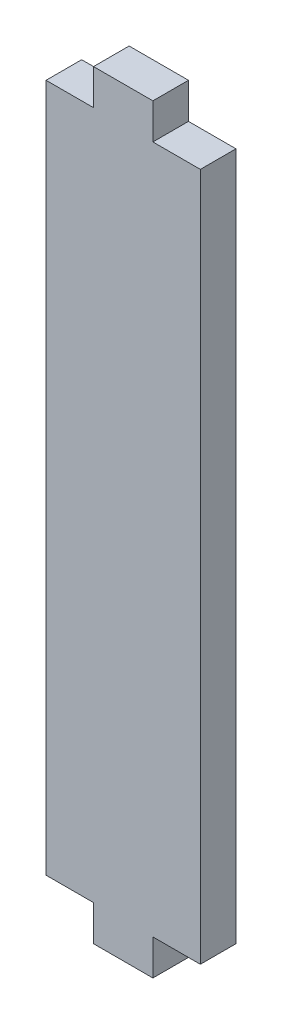
ISO-10303-21;
HEADER;
FILE_DESCRIPTION(('STEP AP214'),'2;1');
FILE_NAME('part.step','',(''),(''),'','','');
FILE_SCHEMA(('AUTOMOTIVE_DESIGN { 1 0 10303 214 1 1 1 1 }'));
ENDSEC;
DATA;
#1=APPLICATION_CONTEXT('core data for automotive mechanical design processes');
#2=APPLICATION_PROTOCOL_DEFINITION('international standard','automotive_design',2000,#1);
#3=PRODUCT_CONTEXT('',#1,'mechanical');
#4=PRODUCT('Part','Part','',(#3));
#5=PRODUCT_RELATED_PRODUCT_CATEGORY('part','',(#4));
#6=PRODUCT_DEFINITION_FORMATION('','',#4);
#7=PRODUCT_DEFINITION_CONTEXT('part definition',#1,'design');
#8=PRODUCT_DEFINITION('design','',#6,#7);
#9=PRODUCT_DEFINITION_SHAPE('','',#8);
#10=(LENGTH_UNIT() NAMED_UNIT(*) SI_UNIT(.MILLI.,.METRE.));
#11=(NAMED_UNIT(*) PLANE_ANGLE_UNIT() SI_UNIT($,.RADIAN.));
#12=(NAMED_UNIT(*) SI_UNIT($,.STERADIAN.) SOLID_ANGLE_UNIT());
#13=UNCERTAINTY_MEASURE_WITH_UNIT(LENGTH_MEASURE(1.E-05),#10,'distance_accuracy_value','');
#14=(GEOMETRIC_REPRESENTATION_CONTEXT(3) GLOBAL_UNCERTAINTY_ASSIGNED_CONTEXT((#13)) GLOBAL_UNIT_ASSIGNED_CONTEXT((#10,
#11,#12)) REPRESENTATION_CONTEXT('',''));
#15=CARTESIAN_POINT('',(0.,0.,0.));
#16=DIRECTION('',(0.,0.,1.));
#17=DIRECTION('',(1.,0.,0.));
#18=AXIS2_PLACEMENT_3D('',#15,#16,#17);
#19=CARTESIAN_POINT('',(6.5,-29.,3.));
#20=DIRECTION('',(0.,1.,0.));
#21=DIRECTION('',(0.,0.,1.));
#22=AXIS2_PLACEMENT_3D('',#19,#20,#21);
#23=PLANE('',#22);
#24=DIRECTION('',(1.,0.,0.));
#25=VECTOR('',#24,1.);
#26=CARTESIAN_POINT('',(6.5,-29.,0.));
#27=LINE('',#26,#25);
#28=CARTESIAN_POINT('',(2.5,-29.,0.));
#29=VERTEX_POINT('',#28);
#30=CARTESIAN_POINT('',(6.5,-29.,0.));
#31=VERTEX_POINT('',#30);
#32=EDGE_CURVE('E157',#29,#31,#27,.T.);
#33=ORIENTED_EDGE('',*,*,#32,.T.);
#34=DIRECTION('',(0.,0.,-1.));
#35=VECTOR('',#34,1.);
#36=CARTESIAN_POINT('',(6.5,-29.,3.));
#37=LINE('',#36,#35);
#38=CARTESIAN_POINT('',(6.5,-29.,3.));
#39=VERTEX_POINT('',#38);
#40=EDGE_CURVE('E11',#39,#31,#37,.T.);
#41=ORIENTED_EDGE('',*,*,#40,.F.);
#42=DIRECTION('',(1.,0.,0.));
#43=VECTOR('',#42,1.);
#44=CARTESIAN_POINT('',(6.5,-29.,3.));
#45=LINE('',#44,#43);
#46=CARTESIAN_POINT('',(2.5,-29.,3.));
#47=VERTEX_POINT('',#46);
#48=EDGE_CURVE('E179',#47,#39,#45,.T.);
#49=ORIENTED_EDGE('',*,*,#48,.F.);
#50=DIRECTION('',(0.,0.,-1.));
#51=VECTOR('',#50,1.);
#52=CARTESIAN_POINT('',(2.5,-29.,3.));
#53=LINE('',#52,#51);
#54=EDGE_CURVE('E153',#47,#29,#53,.T.);
#55=ORIENTED_EDGE('',*,*,#54,.T.);
#56=EDGE_LOOP('',(#33,#41,#49,#55));
#57=FACE_BOUND('',#56,.T.);
#58=ADVANCED_FACE('F37',(#57),#23,.F.);
#59=CARTESIAN_POINT('',(6.5,29.,3.));
#60=DIRECTION('',(-1.,0.,0.));
#61=DIRECTION('',(0.,0.,1.));
#62=AXIS2_PLACEMENT_3D('',#59,#60,#61);
#63=PLANE('',#62);
#64=DIRECTION('',(0.,1.,0.));
#65=VECTOR('',#64,1.);
#66=CARTESIAN_POINT('',(6.5,29.,0.));
#67=LINE('',#66,#65);
#68=CARTESIAN_POINT('',(6.5,29.,0.));
#69=VERTEX_POINT('',#68);
#70=EDGE_CURVE('E160',#31,#69,#67,.T.);
#71=ORIENTED_EDGE('',*,*,#70,.T.);
#72=DIRECTION('',(0.,0.,-1.));
#73=VECTOR('',#72,1.);
#74=CARTESIAN_POINT('',(6.5,29.,3.));
#75=LINE('',#74,#73);
#76=CARTESIAN_POINT('',(6.5,29.,3.));
#77=VERTEX_POINT('',#76);
#78=EDGE_CURVE('E45',#77,#69,#75,.T.);
#79=ORIENTED_EDGE('',*,*,#78,.F.);
#80=DIRECTION('',(0.,1.,0.));
#81=VECTOR('',#80,1.);
#82=CARTESIAN_POINT('',(6.5,29.,3.));
#83=LINE('',#82,#81);
#84=EDGE_CURVE('E108',#39,#77,#83,.T.);
#85=ORIENTED_EDGE('',*,*,#84,.F.);
#86=ORIENTED_EDGE('',*,*,#40,.T.);
#87=EDGE_LOOP('',(#71,#79,#85,#86));
#88=FACE_BOUND('',#87,.T.);
#89=ADVANCED_FACE('F257',(#88),#63,.F.);
#90=CARTESIAN_POINT('',(2.5,29.,3.));
#91=DIRECTION('',(0.,-1.,0.));
#92=DIRECTION('',(0.,0.,-1.));
#93=AXIS2_PLACEMENT_3D('',#90,#91,#92);
#94=PLANE('',#93);
#95=DIRECTION('',(-1.,0.,0.));
#96=VECTOR('',#95,1.);
#97=CARTESIAN_POINT('',(2.5,29.,0.));
#98=LINE('',#97,#96);
#99=CARTESIAN_POINT('',(2.5,29.,0.));
#100=VERTEX_POINT('',#99);
#101=EDGE_CURVE('E162',#69,#100,#98,.T.);
#102=ORIENTED_EDGE('',*,*,#101,.T.);
#103=DIRECTION('',(0.,0.,-1.));
#104=VECTOR('',#103,1.);
#105=CARTESIAN_POINT('',(2.5,29.,3.));
#106=LINE('',#105,#104);
#107=CARTESIAN_POINT('',(2.5,29.,3.));
#108=VERTEX_POINT('',#107);
#109=EDGE_CURVE('E198',#108,#100,#106,.T.);
#110=ORIENTED_EDGE('',*,*,#109,.F.);
#111=DIRECTION('',(-1.,0.,0.));
#112=VECTOR('',#111,1.);
#113=CARTESIAN_POINT('',(2.5,29.,3.));
#114=LINE('',#113,#112);
#115=EDGE_CURVE('E206',#77,#108,#114,.T.);
#116=ORIENTED_EDGE('',*,*,#115,.F.);
#117=ORIENTED_EDGE('',*,*,#78,.T.);
#118=EDGE_LOOP('',(#102,#110,#116,#117));
#119=FACE_BOUND('',#118,.T.);
#120=ADVANCED_FACE('F204',(#119),#94,.F.);
#121=CARTESIAN_POINT('',(2.5,32.,3.));
#122=DIRECTION('',(-1.,0.,0.));
#123=DIRECTION('',(0.,-1.,0.));
#124=AXIS2_PLACEMENT_3D('',#121,#122,#123);
#125=PLANE('',#124);
#126=DIRECTION('',(0.,1.,0.));
#127=VECTOR('',#126,1.);
#128=CARTESIAN_POINT('',(2.5,32.,0.));
#129=LINE('',#128,#127);
#130=CARTESIAN_POINT('',(2.5,32.,0.));
#131=VERTEX_POINT('',#130);
#132=EDGE_CURVE('E164',#100,#131,#129,.T.);
#133=ORIENTED_EDGE('',*,*,#132,.T.);
#134=DIRECTION('',(0.,0.,-1.));
#135=VECTOR('',#134,1.);
#136=CARTESIAN_POINT('',(2.5,32.,3.));
#137=LINE('',#136,#135);
#138=CARTESIAN_POINT('',(2.5,32.,3.));
#139=VERTEX_POINT('',#138);
#140=EDGE_CURVE('E195',#139,#131,#137,.T.);
#141=ORIENTED_EDGE('',*,*,#140,.F.);
#142=DIRECTION('',(0.,1.,0.));
#143=VECTOR('',#142,1.);
#144=CARTESIAN_POINT('',(2.5,32.,3.));
#145=LINE('',#144,#143);
#146=EDGE_CURVE('E224',#108,#139,#145,.T.);
#147=ORIENTED_EDGE('',*,*,#146,.F.);
#148=ORIENTED_EDGE('',*,*,#109,.T.);
#149=EDGE_LOOP('',(#133,#141,#147,#148));
#150=FACE_BOUND('',#149,.T.);
#151=ADVANCED_FACE('F215',(#150),#125,.F.);
#152=CARTESIAN_POINT('',(-2.5,32.,3.));
#153=DIRECTION('',(0.,-1.,0.));
#154=DIRECTION('',(1.,0.,0.));
#155=AXIS2_PLACEMENT_3D('',#152,#153,#154);
#156=PLANE('',#155);
#157=DIRECTION('',(-1.,0.,0.));
#158=VECTOR('',#157,1.);
#159=CARTESIAN_POINT('',(-2.5,32.,0.));
#160=LINE('',#159,#158);
#161=CARTESIAN_POINT('',(-2.5,32.,0.));
#162=VERTEX_POINT('',#161);
#163=EDGE_CURVE('E166',#131,#162,#160,.T.);
#164=ORIENTED_EDGE('',*,*,#163,.T.);
#165=DIRECTION('',(0.,0.,-1.));
#166=VECTOR('',#165,1.);
#167=CARTESIAN_POINT('',(-2.5,32.,3.));
#168=LINE('',#167,#166);
#169=CARTESIAN_POINT('',(-2.5,32.,3.));
#170=VERTEX_POINT('',#169);
#171=EDGE_CURVE('E192',#170,#162,#168,.T.);
#172=ORIENTED_EDGE('',*,*,#171,.F.);
#173=DIRECTION('',(-1.,0.,0.));
#174=VECTOR('',#173,1.);
#175=CARTESIAN_POINT('',(-2.5,32.,3.));
#176=LINE('',#175,#174);
#177=EDGE_CURVE('E221',#139,#170,#176,.T.);
#178=ORIENTED_EDGE('',*,*,#177,.F.);
#179=ORIENTED_EDGE('',*,*,#140,.T.);
#180=EDGE_LOOP('',(#164,#172,#178,#179));
#181=FACE_BOUND('',#180,.T.);
#182=ADVANCED_FACE('F219',(#181),#156,.F.);
#183=CARTESIAN_POINT('',(-2.5,29.,3.));
#184=DIRECTION('',(1.,0.,0.));
#185=DIRECTION('',(0.,1.,0.));
#186=AXIS2_PLACEMENT_3D('',#183,#184,#185);
#187=PLANE('',#186);
#188=DIRECTION('',(0.,-1.,0.));
#189=VECTOR('',#188,1.);
#190=CARTESIAN_POINT('',(-2.5,29.,0.));
#191=LINE('',#190,#189);
#192=CARTESIAN_POINT('',(-2.5,29.,0.));
#193=VERTEX_POINT('',#192);
#194=EDGE_CURVE('E168',#162,#193,#191,.T.);
#195=ORIENTED_EDGE('',*,*,#194,.T.);
#196=DIRECTION('',(0.,0.,-1.));
#197=VECTOR('',#196,1.);
#198=CARTESIAN_POINT('',(-2.5,29.,3.));
#199=LINE('',#198,#197);
#200=CARTESIAN_POINT('',(-2.5,29.,3.));
#201=VERTEX_POINT('',#200);
#202=EDGE_CURVE('E189',#201,#193,#199,.T.);
#203=ORIENTED_EDGE('',*,*,#202,.F.);
#204=DIRECTION('',(0.,-1.,0.));
#205=VECTOR('',#204,1.);
#206=CARTESIAN_POINT('',(-2.5,29.,3.));
#207=LINE('',#206,#205);
#208=EDGE_CURVE('E223',#170,#201,#207,.T.);
#209=ORIENTED_EDGE('',*,*,#208,.F.);
#210=ORIENTED_EDGE('',*,*,#171,.T.);
#211=EDGE_LOOP('',(#195,#203,#209,#210));
#212=FACE_BOUND('',#211,.T.);
#213=ADVANCED_FACE('F270',(#212),#187,.F.);
#214=CARTESIAN_POINT('',(-6.5,29.,3.));
#215=DIRECTION('',(0.,-1.,0.));
#216=DIRECTION('',(0.,0.,-1.));
#217=AXIS2_PLACEMENT_3D('',#214,#215,#216);
#218=PLANE('',#217);
#219=DIRECTION('',(-1.,0.,0.));
#220=VECTOR('',#219,1.);
#221=CARTESIAN_POINT('',(-6.5,29.,0.));
#222=LINE('',#221,#220);
#223=CARTESIAN_POINT('',(-6.5,29.,0.));
#224=VERTEX_POINT('',#223);
#225=EDGE_CURVE('E170',#193,#224,#222,.T.);
#226=ORIENTED_EDGE('',*,*,#225,.T.);
#227=DIRECTION('',(0.,0.,-1.));
#228=VECTOR('',#227,1.);
#229=CARTESIAN_POINT('',(-6.5,29.,3.));
#230=LINE('',#229,#228);
#231=CARTESIAN_POINT('',(-6.5,29.,3.));
#232=VERTEX_POINT('',#231);
#233=EDGE_CURVE('E186',#232,#224,#230,.T.);
#234=ORIENTED_EDGE('',*,*,#233,.F.);
#235=DIRECTION('',(-1.,0.,0.));
#236=VECTOR('',#235,1.);
#237=CARTESIAN_POINT('',(-6.5,29.,3.));
#238=LINE('',#237,#236);
#239=EDGE_CURVE('E226',#201,#232,#238,.T.);
#240=ORIENTED_EDGE('',*,*,#239,.F.);
#241=ORIENTED_EDGE('',*,*,#202,.T.);
#242=EDGE_LOOP('',(#226,#234,#240,#241));
#243=FACE_BOUND('',#242,.T.);
#244=ADVANCED_FACE('F273',(#243),#218,.F.);
#245=CARTESIAN_POINT('',(-6.5,29.,3.));
#246=DIRECTION('',(1.,0.,0.));
#247=DIRECTION('',(0.,0.,-1.));
#248=AXIS2_PLACEMENT_3D('',#245,#246,#247);
#249=PLANE('',#248);
#250=DIRECTION('',(0.,-1.,0.));
#251=VECTOR('',#250,1.);
#252=CARTESIAN_POINT('',(-6.5,29.,0.));
#253=LINE('',#252,#251);
#254=CARTESIAN_POINT('',(-6.5,-29.,0.));
#255=VERTEX_POINT('',#254);
#256=EDGE_CURVE('E172',#224,#255,#253,.T.);
#257=ORIENTED_EDGE('',*,*,#256,.T.);
#258=DIRECTION('',(0.,0.,-1.));
#259=VECTOR('',#258,1.);
#260=CARTESIAN_POINT('',(-6.5,-29.,3.));
#261=LINE('',#260,#259);
#262=CARTESIAN_POINT('',(-6.5,-29.,3.));
#263=VERTEX_POINT('',#262);
#264=EDGE_CURVE('E183',#263,#255,#261,.T.);
#265=ORIENTED_EDGE('',*,*,#264,.F.);
#266=DIRECTION('',(0.,-1.,0.));
#267=VECTOR('',#266,1.);
#268=CARTESIAN_POINT('',(-6.5,29.,3.));
#269=LINE('',#268,#267);
#270=EDGE_CURVE('E232',#232,#263,#269,.T.);
#271=ORIENTED_EDGE('',*,*,#270,.F.);
#272=ORIENTED_EDGE('',*,*,#233,.T.);
#273=EDGE_LOOP('',(#257,#265,#271,#272));
#274=FACE_BOUND('',#273,.T.);
#275=ADVANCED_FACE('F238',(#274),#249,.F.);
#276=CARTESIAN_POINT('',(-2.5,-29.,3.));
#277=DIRECTION('',(0.,1.,0.));
#278=DIRECTION('',(0.,0.,1.));
#279=AXIS2_PLACEMENT_3D('',#276,#277,#278);
#280=PLANE('',#279);
#281=DIRECTION('',(1.,0.,0.));
#282=VECTOR('',#281,1.);
#283=CARTESIAN_POINT('',(-2.5,-29.,0.));
#284=LINE('',#283,#282);
#285=CARTESIAN_POINT('',(-2.5,-29.,0.));
#286=VERTEX_POINT('',#285);
#287=EDGE_CURVE('E174',#255,#286,#284,.T.);
#288=ORIENTED_EDGE('',*,*,#287,.T.);
#289=DIRECTION('',(0.,0.,-1.));
#290=VECTOR('',#289,1.);
#291=CARTESIAN_POINT('',(-2.5,-29.,3.));
#292=LINE('',#291,#290);
#293=CARTESIAN_POINT('',(-2.5,-29.,3.));
#294=VERTEX_POINT('',#293);
#295=EDGE_CURVE('E148',#294,#286,#292,.T.);
#296=ORIENTED_EDGE('',*,*,#295,.F.);
#297=DIRECTION('',(1.,0.,0.));
#298=VECTOR('',#297,1.);
#299=CARTESIAN_POINT('',(-2.5,-29.,3.));
#300=LINE('',#299,#298);
#301=EDGE_CURVE('E139',#263,#294,#300,.T.);
#302=ORIENTED_EDGE('',*,*,#301,.F.);
#303=ORIENTED_EDGE('',*,*,#264,.T.);
#304=EDGE_LOOP('',(#288,#296,#302,#303));
#305=FACE_BOUND('',#304,.T.);
#306=ADVANCED_FACE('F242',(#305),#280,.F.);
#307=CARTESIAN_POINT('',(-2.5,-32.,3.));
#308=DIRECTION('',(1.,0.,0.));
#309=DIRECTION('',(0.,0.,-1.));
#310=AXIS2_PLACEMENT_3D('',#307,#308,#309);
#311=PLANE('',#310);
#312=DIRECTION('',(0.,-1.,0.));
#313=VECTOR('',#312,1.);
#314=CARTESIAN_POINT('',(-2.5,-32.,0.));
#315=LINE('',#314,#313);
#316=CARTESIAN_POINT('',(-2.5,-32.,0.));
#317=VERTEX_POINT('',#316);
#318=EDGE_CURVE('E147',#286,#317,#315,.T.);
#319=ORIENTED_EDGE('',*,*,#318,.T.);
#320=DIRECTION('',(0.,0.,-1.));
#321=VECTOR('',#320,1.);
#322=CARTESIAN_POINT('',(-2.5,-32.,3.));
#323=LINE('',#322,#321);
#324=CARTESIAN_POINT('',(-2.5,-32.,3.));
#325=VERTEX_POINT('',#324);
#326=EDGE_CURVE('E144',#325,#317,#323,.T.);
#327=ORIENTED_EDGE('',*,*,#326,.F.);
#328=DIRECTION('',(0.,-1.,0.));
#329=VECTOR('',#328,1.);
#330=CARTESIAN_POINT('',(-2.5,-32.,3.));
#331=LINE('',#330,#329);
#332=EDGE_CURVE('E133',#294,#325,#331,.T.);
#333=ORIENTED_EDGE('',*,*,#332,.F.);
#334=ORIENTED_EDGE('',*,*,#295,.T.);
#335=EDGE_LOOP('',(#319,#327,#333,#334));
#336=FACE_BOUND('',#335,.T.);
#337=ADVANCED_FACE('F145',(#336),#311,.F.);
#338=CARTESIAN_POINT('',(2.5,-32.,3.));
#339=DIRECTION('',(0.,1.,0.));
#340=DIRECTION('',(0.,0.,1.));
#341=AXIS2_PLACEMENT_3D('',#338,#339,#340);
#342=PLANE('',#341);
#343=DIRECTION('',(1.,0.,0.));
#344=VECTOR('',#343,1.);
#345=CARTESIAN_POINT('',(2.5,-32.,0.));
#346=LINE('',#345,#344);
#347=CARTESIAN_POINT('',(2.5,-32.,0.));
#348=VERTEX_POINT('',#347);
#349=EDGE_CURVE('E94',#317,#348,#346,.T.);
#350=ORIENTED_EDGE('',*,*,#349,.T.);
#351=DIRECTION('',(0.,0.,-1.));
#352=VECTOR('',#351,1.);
#353=CARTESIAN_POINT('',(2.5,-32.,3.));
#354=LINE('',#353,#352);
#355=CARTESIAN_POINT('',(2.5,-32.,3.));
#356=VERTEX_POINT('',#355);
#357=EDGE_CURVE('E149',#356,#348,#354,.T.);
#358=ORIENTED_EDGE('',*,*,#357,.F.);
#359=DIRECTION('',(1.,0.,0.));
#360=VECTOR('',#359,1.);
#361=CARTESIAN_POINT('',(2.5,-32.,3.));
#362=LINE('',#361,#360);
#363=EDGE_CURVE('E137',#325,#356,#362,.T.);
#364=ORIENTED_EDGE('',*,*,#363,.F.);
#365=ORIENTED_EDGE('',*,*,#326,.T.);
#366=EDGE_LOOP('',(#350,#358,#364,#365));
#367=FACE_BOUND('',#366,.T.);
#368=ADVANCED_FACE('F151',(#367),#342,.F.);
#369=CARTESIAN_POINT('',(2.5,-29.,3.));
#370=DIRECTION('',(-1.,0.,0.));
#371=DIRECTION('',(0.,0.,1.));
#372=AXIS2_PLACEMENT_3D('',#369,#370,#371);
#373=PLANE('',#372);
#374=DIRECTION('',(0.,1.,0.));
#375=VECTOR('',#374,1.);
#376=CARTESIAN_POINT('',(2.5,-29.,0.));
#377=LINE('',#376,#375);
#378=EDGE_CURVE('E100',#348,#29,#377,.T.);
#379=ORIENTED_EDGE('',*,*,#378,.T.);
#380=ORIENTED_EDGE('',*,*,#54,.F.);
#381=DIRECTION('',(0.,1.,0.));
#382=VECTOR('',#381,1.);
#383=CARTESIAN_POINT('',(2.5,-29.,3.));
#384=LINE('',#383,#382);
#385=EDGE_CURVE('E53',#356,#47,#384,.T.);
#386=ORIENTED_EDGE('',*,*,#385,.F.);
#387=ORIENTED_EDGE('',*,*,#357,.T.);
#388=EDGE_LOOP('',(#379,#380,#386,#387));
#389=FACE_BOUND('',#388,.T.);
#390=ADVANCED_FACE('F246',(#389),#373,.F.);
#391=CARTESIAN_POINT('',(0.,0.,3.));
#392=DIRECTION('',(0.,0.,1.));
#393=DIRECTION('',(1.,0.,0.));
#394=AXIS2_PLACEMENT_3D('',#391,#392,#393);
#395=PLANE('',#394);
#396=ORIENTED_EDGE('',*,*,#48,.T.);
#397=ORIENTED_EDGE('',*,*,#84,.T.);
#398=ORIENTED_EDGE('',*,*,#115,.T.);
#399=ORIENTED_EDGE('',*,*,#146,.T.);
#400=ORIENTED_EDGE('',*,*,#177,.T.);
#401=ORIENTED_EDGE('',*,*,#208,.T.);
#402=ORIENTED_EDGE('',*,*,#239,.T.);
#403=ORIENTED_EDGE('',*,*,#270,.T.);
#404=ORIENTED_EDGE('',*,*,#301,.T.);
#405=ORIENTED_EDGE('',*,*,#332,.T.);
#406=ORIENTED_EDGE('',*,*,#363,.T.);
#407=ORIENTED_EDGE('',*,*,#385,.T.);
#408=EDGE_LOOP('',(#396,#397,#398,#399,#400,#401,#402,#403,#404,#405,#406,#407));
#409=FACE_BOUND('',#408,.T.);
#410=ADVANCED_FACE('F135',(#409),#395,.T.);
#411=CARTESIAN_POINT('',(0.,0.,0.));
#412=DIRECTION('',(0.,0.,1.));
#413=DIRECTION('',(1.,0.,0.));
#414=AXIS2_PLACEMENT_3D('',#411,#412,#413);
#415=PLANE('',#414);
#416=ORIENTED_EDGE('',*,*,#32,.F.);
#417=ORIENTED_EDGE('',*,*,#378,.F.);
#418=ORIENTED_EDGE('',*,*,#349,.F.);
#419=ORIENTED_EDGE('',*,*,#318,.F.);
#420=ORIENTED_EDGE('',*,*,#287,.F.);
#421=ORIENTED_EDGE('',*,*,#256,.F.);
#422=ORIENTED_EDGE('',*,*,#225,.F.);
#423=ORIENTED_EDGE('',*,*,#194,.F.);
#424=ORIENTED_EDGE('',*,*,#163,.F.);
#425=ORIENTED_EDGE('',*,*,#132,.F.);
#426=ORIENTED_EDGE('',*,*,#101,.F.);
#427=ORIENTED_EDGE('',*,*,#70,.F.);
#428=EDGE_LOOP('',(#416,#417,#418,#419,#420,#421,#422,#423,#424,#425,#426,#427));
#429=FACE_BOUND('',#428,.T.);
#430=ADVANCED_FACE('F210',(#429),#415,.F.);
#431=CLOSED_SHELL('',(#58,#89,#120,#151,#182,#213,#244,#275,#306,#337,#368,#390,#410,#430));
#432=MANIFOLD_SOLID_BREP('B2',#431);
#433=ADVANCED_BREP_SHAPE_REPRESENTATION('',(#18,#432),#14);
#434=SHAPE_DEFINITION_REPRESENTATION(#9,#433);
ENDSEC;
END-ISO-10303-21;
